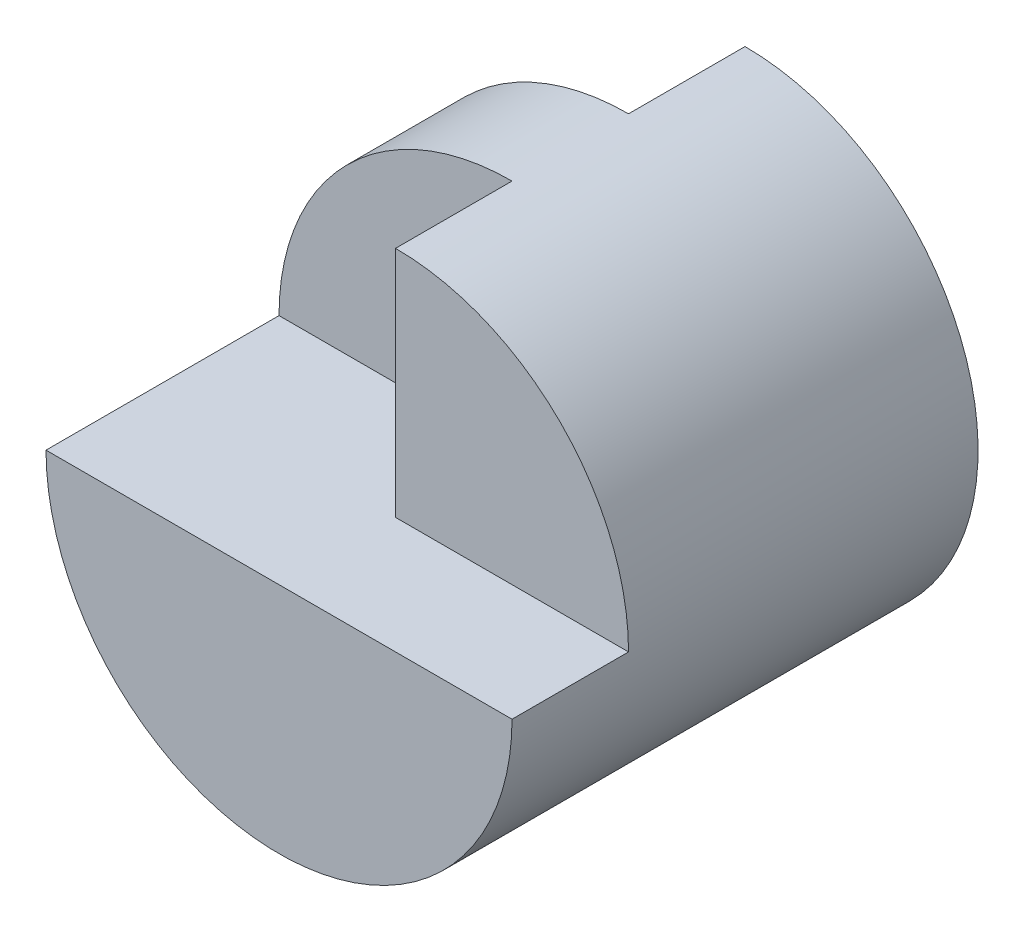
ISO-10303-21;
HEADER;
FILE_DESCRIPTION(('STEP AP214'),'2;1');
FILE_NAME('part.step','',(''),(''),'','','');
FILE_SCHEMA(('AUTOMOTIVE_DESIGN { 1 0 10303 214 1 1 1 1 }'));
ENDSEC;
DATA;
#1=APPLICATION_CONTEXT('core data for automotive mechanical design processes');
#2=APPLICATION_PROTOCOL_DEFINITION('international standard','automotive_design',2000,#1);
#3=PRODUCT_CONTEXT('',#1,'mechanical');
#4=PRODUCT('Part','Part','',(#3));
#5=PRODUCT_RELATED_PRODUCT_CATEGORY('part','',(#4));
#6=PRODUCT_DEFINITION_FORMATION('','',#4);
#7=PRODUCT_DEFINITION_CONTEXT('part definition',#1,'design');
#8=PRODUCT_DEFINITION('design','',#6,#7);
#9=PRODUCT_DEFINITION_SHAPE('','',#8);
#10=(LENGTH_UNIT() NAMED_UNIT(*) SI_UNIT(.MILLI.,.METRE.));
#11=(NAMED_UNIT(*) PLANE_ANGLE_UNIT() SI_UNIT($,.RADIAN.));
#12=(NAMED_UNIT(*) SI_UNIT($,.STERADIAN.) SOLID_ANGLE_UNIT());
#13=UNCERTAINTY_MEASURE_WITH_UNIT(LENGTH_MEASURE(1.E-05),#10,'distance_accuracy_value','');
#14=(GEOMETRIC_REPRESENTATION_CONTEXT(3) GLOBAL_UNCERTAINTY_ASSIGNED_CONTEXT((#13)) GLOBAL_UNIT_ASSIGNED_CONTEXT((#10,
#11,#12)) REPRESENTATION_CONTEXT('',''));
#15=CARTESIAN_POINT('',(0.,0.,0.));
#16=DIRECTION('',(0.,0.,1.));
#17=DIRECTION('',(1.,0.,0.));
#18=AXIS2_PLACEMENT_3D('',#15,#16,#17);
#19=CARTESIAN_POINT('',(0.,0.,40.));
#20=DIRECTION('',(0.,0.,-1.));
#21=DIRECTION('',(-1.,0.,0.));
#22=AXIS2_PLACEMENT_3D('',#19,#20,#21);
#23=CYLINDRICAL_SURFACE('',#22,20.);
#24=DIRECTION('',(0.,0.,-1.));
#25=VECTOR('',#24,1.);
#26=CARTESIAN_POINT('',(-20.,0.,40.));
#27=LINE('',#26,#25);
#28=CARTESIAN_POINT('',(-20.,0.,40.));
#29=VERTEX_POINT('',#28);
#30=CARTESIAN_POINT('',(-20.,0.,20.));
#31=VERTEX_POINT('',#30);
#32=EDGE_CURVE('E55',#29,#31,#27,.T.);
#33=ORIENTED_EDGE('',*,*,#32,.T.);
#34=CARTESIAN_POINT('',(0.,0.,20.));
#35=DIRECTION('',(0.,0.,1.));
#36=DIRECTION('',(1.,0.,0.));
#37=AXIS2_PLACEMENT_3D('',#34,#35,#36);
#38=CIRCLE('',#37,20.);
#39=CARTESIAN_POINT('',(0.,20.,20.));
#40=VERTEX_POINT('',#39);
#41=EDGE_CURVE('E125',#40,#31,#38,.T.);
#42=ORIENTED_EDGE('',*,*,#41,.F.);
#43=DIRECTION('',(0.,0.,1.));
#44=VECTOR('',#43,1.);
#45=CARTESIAN_POINT('',(0.,20.,20.));
#46=LINE('',#45,#44);
#47=CARTESIAN_POINT('',(0.,20.,30.));
#48=VERTEX_POINT('',#47);
#49=EDGE_CURVE('E130',#40,#48,#46,.T.);
#50=ORIENTED_EDGE('',*,*,#49,.T.);
#51=CARTESIAN_POINT('',(0.,0.,30.));
#52=DIRECTION('',(0.,0.,-1.));
#53=DIRECTION('',(-1.,0.,0.));
#54=AXIS2_PLACEMENT_3D('',#51,#52,#53);
#55=CIRCLE('',#54,20.);
#56=CARTESIAN_POINT('',(20.,0.,30.));
#57=VERTEX_POINT('',#56);
#58=EDGE_CURVE('E11',#48,#57,#55,.T.);
#59=ORIENTED_EDGE('',*,*,#58,.T.);
#60=DIRECTION('',(0.,0.,-1.));
#61=VECTOR('',#60,1.);
#62=CARTESIAN_POINT('',(20.,0.,40.));
#63=LINE('',#62,#61);
#64=CARTESIAN_POINT('',(20.,0.,40.));
#65=VERTEX_POINT('',#64);
#66=EDGE_CURVE('E137',#57,#65,#63,.F.);
#67=ORIENTED_EDGE('',*,*,#66,.T.);
#68=CARTESIAN_POINT('',(0.,0.,40.));
#69=DIRECTION('',(0.,0.,1.));
#70=DIRECTION('',(1.,0.,0.));
#71=AXIS2_PLACEMENT_3D('',#68,#69,#70);
#72=CIRCLE('',#71,20.);
#73=EDGE_CURVE('E142',#29,#65,#72,.T.);
#74=ORIENTED_EDGE('',*,*,#73,.F.);
#75=EDGE_LOOP('',(#33,#42,#50,#59,#67,#74));
#76=FACE_BOUND('',#75,.T.);
#77=CARTESIAN_POINT('',(0.,0.,10.));
#78=DIRECTION('',(0.,0.,-1.));
#79=DIRECTION('',(1.,0.,0.));
#80=AXIS2_PLACEMENT_3D('',#77,#78,#79);
#81=CIRCLE('',#80,20.);
#82=CARTESIAN_POINT('',(-20.,0.,10.));
#83=VERTEX_POINT('',#82);
#84=CARTESIAN_POINT('',(0.,20.,10.));
#85=VERTEX_POINT('',#84);
#86=EDGE_CURVE('E107',#83,#85,#81,.T.);
#87=ORIENTED_EDGE('',*,*,#86,.F.);
#88=DIRECTION('',(0.,0.,-1.));
#89=VECTOR('',#88,1.);
#90=CARTESIAN_POINT('',(-20.,0.,10.));
#91=LINE('',#90,#89);
#92=CARTESIAN_POINT('',(-20.,0.,0.));
#93=VERTEX_POINT('',#92);
#94=EDGE_CURVE('E92',#83,#93,#91,.T.);
#95=ORIENTED_EDGE('',*,*,#94,.T.);
#96=CARTESIAN_POINT('',(0.,0.,0.));
#97=DIRECTION('',(0.,0.,1.));
#98=DIRECTION('',(1.,0.,0.));
#99=AXIS2_PLACEMENT_3D('',#96,#97,#98);
#100=CIRCLE('',#99,20.);
#101=CARTESIAN_POINT('',(0.,20.,0.));
#102=VERTEX_POINT('',#101);
#103=EDGE_CURVE('E141',#93,#102,#100,.T.);
#104=ORIENTED_EDGE('',*,*,#103,.T.);
#105=DIRECTION('',(0.,0.,-1.));
#106=VECTOR('',#105,1.);
#107=CARTESIAN_POINT('',(0.,20.,10.));
#108=LINE('',#107,#106);
#109=EDGE_CURVE('E47',#85,#102,#108,.T.);
#110=ORIENTED_EDGE('',*,*,#109,.F.);
#111=EDGE_LOOP('',(#87,#95,#104,#110));
#112=FACE_BOUND('',#111,.T.);
#113=ADVANCED_FACE('F33',(#76,#112),#23,.T.);
#114=CARTESIAN_POINT('',(0.,0.,40.));
#115=DIRECTION('',(0.,0.,1.));
#116=DIRECTION('',(1.,0.,0.));
#117=AXIS2_PLACEMENT_3D('',#114,#115,#116);
#118=PLANE('',#117);
#119=DIRECTION('',(1.,0.,0.));
#120=VECTOR('',#119,1.);
#121=CARTESIAN_POINT('',(0.,0.,40.));
#122=LINE('',#121,#120);
#123=EDGE_CURVE('E40',#29,#65,#122,.T.);
#124=ORIENTED_EDGE('',*,*,#123,.F.);
#125=ORIENTED_EDGE('',*,*,#73,.T.);
#126=EDGE_LOOP('',(#124,#125));
#127=FACE_BOUND('',#126,.T.);
#128=ADVANCED_FACE('F152',(#127),#118,.T.);
#129=CARTESIAN_POINT('',(0.,0.,0.));
#130=DIRECTION('',(0.,0.,1.));
#131=DIRECTION('',(1.,0.,0.));
#132=AXIS2_PLACEMENT_3D('',#129,#130,#131);
#133=PLANE('',#132);
#134=ORIENTED_EDGE('',*,*,#103,.F.);
#135=DIRECTION('',(-1.,0.,0.));
#136=VECTOR('',#135,1.);
#137=CARTESIAN_POINT('',(0.,0.,0.));
#138=LINE('',#137,#136);
#139=CARTESIAN_POINT('',(0.,0.,0.));
#140=VERTEX_POINT('',#139);
#141=EDGE_CURVE('E98',#140,#93,#138,.T.);
#142=ORIENTED_EDGE('',*,*,#141,.F.);
#143=DIRECTION('',(0.,-1.,0.));
#144=VECTOR('',#143,1.);
#145=CARTESIAN_POINT('',(0.,20.,0.));
#146=LINE('',#145,#144);
#147=EDGE_CURVE('E108',#102,#140,#146,.T.);
#148=ORIENTED_EDGE('',*,*,#147,.F.);
#149=EDGE_LOOP('',(#134,#142,#148));
#150=FACE_BOUND('',#149,.T.);
#151=ADVANCED_FACE('F154',(#150),#133,.F.);
#152=CARTESIAN_POINT('',(-40.,20.,30.));
#153=DIRECTION('',(0.,0.,-1.));
#154=DIRECTION('',(-1.,0.,0.));
#155=AXIS2_PLACEMENT_3D('',#152,#153,#154);
#156=PLANE('',#155);
#157=ORIENTED_EDGE('',*,*,#58,.F.);
#158=DIRECTION('',(0.,1.,0.));
#159=VECTOR('',#158,1.);
#160=CARTESIAN_POINT('',(0.,0.,30.));
#161=LINE('',#160,#159);
#162=CARTESIAN_POINT('',(0.,0.,30.));
#163=VERTEX_POINT('',#162);
#164=EDGE_CURVE('E117',#163,#48,#161,.T.);
#165=ORIENTED_EDGE('',*,*,#164,.F.);
#166=DIRECTION('',(1.,0.,0.));
#167=VECTOR('',#166,1.);
#168=CARTESIAN_POINT('',(-40.,0.,30.));
#169=LINE('',#168,#167);
#170=EDGE_CURVE('E133',#163,#57,#169,.T.);
#171=ORIENTED_EDGE('',*,*,#170,.T.);
#172=EDGE_LOOP('',(#157,#165,#171));
#173=FACE_BOUND('',#172,.T.);
#174=ADVANCED_FACE('F160',(#173),#156,.F.);
#175=CARTESIAN_POINT('',(-40.,0.,40.));
#176=DIRECTION('',(0.,-1.,0.));
#177=DIRECTION('',(0.,0.,-1.));
#178=AXIS2_PLACEMENT_3D('',#175,#176,#177);
#179=PLANE('',#178);
#180=ORIENTED_EDGE('',*,*,#123,.T.);
#181=ORIENTED_EDGE('',*,*,#66,.F.);
#182=ORIENTED_EDGE('',*,*,#170,.F.);
#183=DIRECTION('',(0.,0.,1.));
#184=VECTOR('',#183,1.);
#185=CARTESIAN_POINT('',(0.,0.,20.));
#186=LINE('',#185,#184);
#187=CARTESIAN_POINT('',(0.,0.,20.));
#188=VERTEX_POINT('',#187);
#189=EDGE_CURVE('E128',#188,#163,#186,.T.);
#190=ORIENTED_EDGE('',*,*,#189,.F.);
#191=DIRECTION('',(1.,0.,0.));
#192=VECTOR('',#191,1.);
#193=CARTESIAN_POINT('',(0.,0.,20.));
#194=LINE('',#193,#192);
#195=EDGE_CURVE('E119',#31,#188,#194,.T.);
#196=ORIENTED_EDGE('',*,*,#195,.F.);
#197=ORIENTED_EDGE('',*,*,#32,.F.);
#198=EDGE_LOOP('',(#180,#181,#182,#190,#196,#197));
#199=FACE_BOUND('',#198,.T.);
#200=ADVANCED_FACE('F146',(#199),#179,.F.);
#201=CARTESIAN_POINT('',(0.,0.,20.));
#202=DIRECTION('',(1.,0.,0.));
#203=DIRECTION('',(0.,1.,0.));
#204=AXIS2_PLACEMENT_3D('',#201,#202,#203);
#205=PLANE('',#204);
#206=ORIENTED_EDGE('',*,*,#164,.T.);
#207=ORIENTED_EDGE('',*,*,#49,.F.);
#208=DIRECTION('',(0.,1.,0.));
#209=VECTOR('',#208,1.);
#210=CARTESIAN_POINT('',(0.,0.,20.));
#211=LINE('',#210,#209);
#212=EDGE_CURVE('E122',#188,#40,#211,.T.);
#213=ORIENTED_EDGE('',*,*,#212,.F.);
#214=ORIENTED_EDGE('',*,*,#189,.T.);
#215=EDGE_LOOP('',(#206,#207,#213,#214));
#216=FACE_BOUND('',#215,.T.);
#217=ADVANCED_FACE('F165',(#216),#205,.F.);
#218=CARTESIAN_POINT('',(0.,0.,20.));
#219=DIRECTION('',(0.,0.,1.));
#220=DIRECTION('',(1.,0.,0.));
#221=AXIS2_PLACEMENT_3D('',#218,#219,#220);
#222=PLANE('',#221);
#223=ORIENTED_EDGE('',*,*,#195,.T.);
#224=ORIENTED_EDGE('',*,*,#212,.T.);
#225=ORIENTED_EDGE('',*,*,#41,.T.);
#226=EDGE_LOOP('',(#223,#224,#225));
#227=FACE_BOUND('',#226,.T.);
#228=ADVANCED_FACE('F171',(#227),#222,.T.);
#229=CARTESIAN_POINT('',(0.,0.,10.));
#230=DIRECTION('',(0.,-1.,0.));
#231=DIRECTION('',(0.,0.,-1.));
#232=AXIS2_PLACEMENT_3D('',#229,#230,#231);
#233=PLANE('',#232);
#234=ORIENTED_EDGE('',*,*,#141,.T.);
#235=ORIENTED_EDGE('',*,*,#94,.F.);
#236=DIRECTION('',(-1.,0.,0.));
#237=VECTOR('',#236,1.);
#238=CARTESIAN_POINT('',(0.,0.,10.));
#239=LINE('',#238,#237);
#240=CARTESIAN_POINT('',(0.,0.,10.));
#241=VERTEX_POINT('',#240);
#242=EDGE_CURVE('E95',#241,#83,#239,.T.);
#243=ORIENTED_EDGE('',*,*,#242,.F.);
#244=DIRECTION('',(0.,0.,-1.));
#245=VECTOR('',#244,1.);
#246=CARTESIAN_POINT('',(0.,0.,10.));
#247=LINE('',#246,#245);
#248=EDGE_CURVE('E115',#241,#140,#247,.T.);
#249=ORIENTED_EDGE('',*,*,#248,.T.);
#250=EDGE_LOOP('',(#234,#235,#243,#249));
#251=FACE_BOUND('',#250,.T.);
#252=ADVANCED_FACE('F94',(#251),#233,.F.);
#253=CARTESIAN_POINT('',(0.,20.,10.));
#254=DIRECTION('',(1.,0.,0.));
#255=DIRECTION('',(0.,0.,-1.));
#256=AXIS2_PLACEMENT_3D('',#253,#254,#255);
#257=PLANE('',#256);
#258=ORIENTED_EDGE('',*,*,#147,.T.);
#259=ORIENTED_EDGE('',*,*,#248,.F.);
#260=DIRECTION('',(0.,-1.,0.));
#261=VECTOR('',#260,1.);
#262=CARTESIAN_POINT('',(0.,20.,10.));
#263=LINE('',#262,#261);
#264=EDGE_CURVE('E103',#85,#241,#263,.T.);
#265=ORIENTED_EDGE('',*,*,#264,.F.);
#266=ORIENTED_EDGE('',*,*,#109,.T.);
#267=EDGE_LOOP('',(#258,#259,#265,#266));
#268=FACE_BOUND('',#267,.T.);
#269=ADVANCED_FACE('F178',(#268),#257,.F.);
#270=CARTESIAN_POINT('',(0.,0.,10.));
#271=DIRECTION('',(0.,0.,1.));
#272=DIRECTION('',(1.,0.,0.));
#273=AXIS2_PLACEMENT_3D('',#270,#271,#272);
#274=PLANE('',#273);
#275=ORIENTED_EDGE('',*,*,#242,.T.);
#276=ORIENTED_EDGE('',*,*,#86,.T.);
#277=ORIENTED_EDGE('',*,*,#264,.T.);
#278=EDGE_LOOP('',(#275,#276,#277));
#279=FACE_BOUND('',#278,.T.);
#280=ADVANCED_FACE('F106',(#279),#274,.F.);
#281=CLOSED_SHELL('',(#113,#128,#151,#174,#200,#217,#228,#252,#269,#280));
#282=MANIFOLD_SOLID_BREP('B2',#281);
#283=ADVANCED_BREP_SHAPE_REPRESENTATION('',(#18,#282),#14);
#284=SHAPE_DEFINITION_REPRESENTATION(#9,#283);
ENDSEC;
END-ISO-10303-21;
